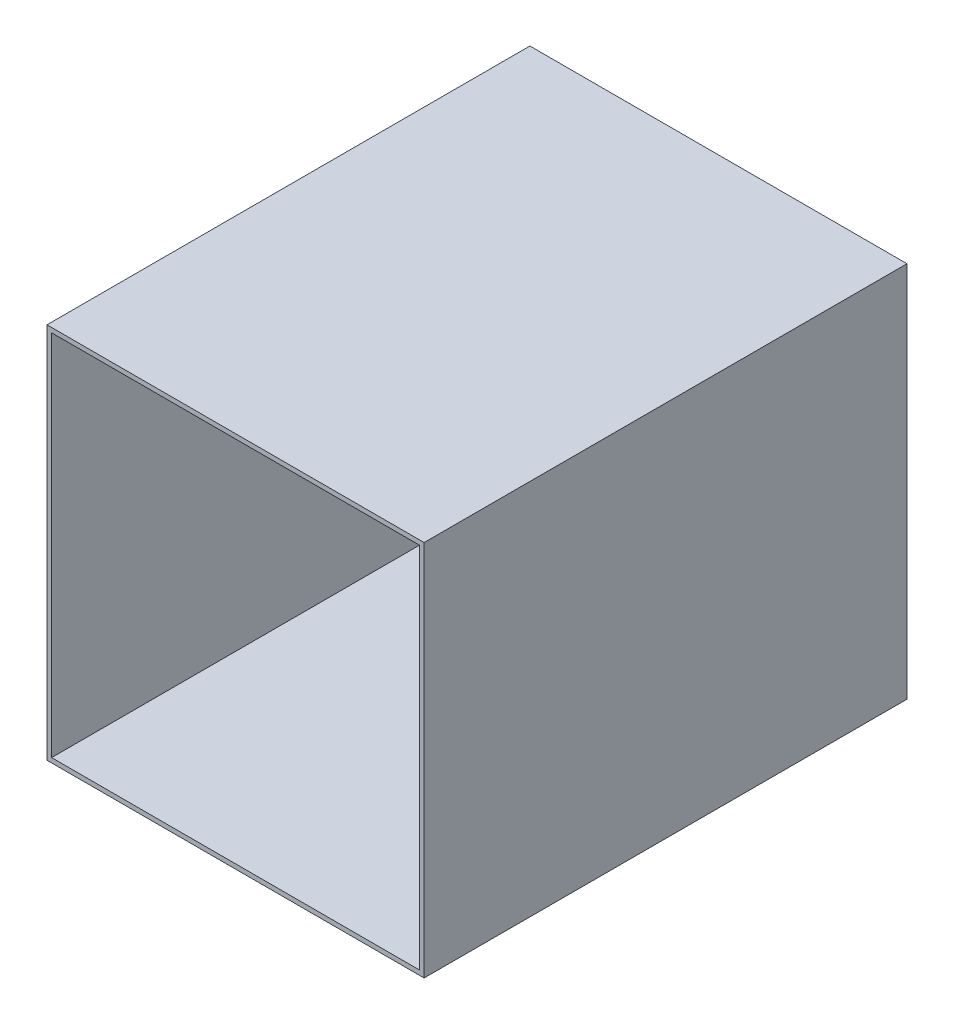
ISO-10303-21;
HEADER;
FILE_DESCRIPTION(('STEP AP214'),'2;1');
FILE_NAME('part.step','',(''),(''),'','','');
FILE_SCHEMA(('AUTOMOTIVE_DESIGN { 1 0 10303 214 1 1 1 1 }'));
ENDSEC;
DATA;
#1=APPLICATION_CONTEXT('core data for automotive mechanical design processes');
#2=APPLICATION_PROTOCOL_DEFINITION('international standard','automotive_design',2000,#1);
#3=PRODUCT_CONTEXT('',#1,'mechanical');
#4=PRODUCT('Part','Part','',(#3));
#5=PRODUCT_RELATED_PRODUCT_CATEGORY('part','',(#4));
#6=PRODUCT_DEFINITION_FORMATION('','',#4);
#7=PRODUCT_DEFINITION_CONTEXT('part definition',#1,'design');
#8=PRODUCT_DEFINITION('design','',#6,#7);
#9=PRODUCT_DEFINITION_SHAPE('','',#8);
#10=(LENGTH_UNIT() NAMED_UNIT(*) SI_UNIT(.MILLI.,.METRE.));
#11=(NAMED_UNIT(*) PLANE_ANGLE_UNIT() SI_UNIT($,.RADIAN.));
#12=(NAMED_UNIT(*) SI_UNIT($,.STERADIAN.) SOLID_ANGLE_UNIT());
#13=UNCERTAINTY_MEASURE_WITH_UNIT(LENGTH_MEASURE(1.E-05),#10,'distance_accuracy_value','');
#14=(GEOMETRIC_REPRESENTATION_CONTEXT(3) GLOBAL_UNCERTAINTY_ASSIGNED_CONTEXT((#13)) GLOBAL_UNIT_ASSIGNED_CONTEXT((#10,
#11,#12)) REPRESENTATION_CONTEXT('',''));
#15=CARTESIAN_POINT('',(0.,0.,0.));
#16=DIRECTION('',(0.,0.,1.));
#17=DIRECTION('',(1.,0.,0.));
#18=AXIS2_PLACEMENT_3D('',#15,#16,#17);
#19=CARTESIAN_POINT('',(0.,0.,330.2));
#20=DIRECTION('',(0.,0.,-1.));
#21=DIRECTION('',(-1.,0.,0.));
#22=AXIS2_PLACEMENT_3D('',#19,#20,#21);
#23=PLANE('',#22);
#24=DIRECTION('',(0.,-1.,0.));
#25=VECTOR('',#24,1.);
#26=CARTESIAN_POINT('',(-3.175,-3.175,330.2));
#27=LINE('',#26,#25);
#28=CARTESIAN_POINT('',(-3.175,257.175,330.2));
#29=VERTEX_POINT('',#28);
#30=CARTESIAN_POINT('',(-3.175,-3.175,330.2));
#31=VERTEX_POINT('',#30);
#32=EDGE_CURVE('E103',#29,#31,#27,.T.);
#33=ORIENTED_EDGE('',*,*,#32,.T.);
#34=DIRECTION('',(1.,0.,0.));
#35=VECTOR('',#34,1.);
#36=CARTESIAN_POINT('',(-3.175,-3.175,330.2));
#37=LINE('',#36,#35);
#38=CARTESIAN_POINT('',(257.175,-3.175,330.2));
#39=VERTEX_POINT('',#38);
#40=EDGE_CURVE('E152',#31,#39,#37,.T.);
#41=ORIENTED_EDGE('',*,*,#40,.T.);
#42=DIRECTION('',(0.,1.,0.));
#43=VECTOR('',#42,1.);
#44=CARTESIAN_POINT('',(257.175,-3.175,330.2));
#45=LINE('',#44,#43);
#46=CARTESIAN_POINT('',(257.175,257.175,330.2));
#47=VERTEX_POINT('',#46);
#48=EDGE_CURVE('E154',#39,#47,#45,.T.);
#49=ORIENTED_EDGE('',*,*,#48,.T.);
#50=DIRECTION('',(-1.,0.,0.));
#51=VECTOR('',#50,1.);
#52=CARTESIAN_POINT('',(-3.175,257.175,330.2));
#53=LINE('',#52,#51);
#54=EDGE_CURVE('E55',#47,#29,#53,.T.);
#55=ORIENTED_EDGE('',*,*,#54,.T.);
#56=EDGE_LOOP('',(#33,#41,#49,#55));
#57=FACE_BOUND('',#56,.T.);
#58=DIRECTION('',(0.,-1.,0.));
#59=VECTOR('',#58,1.);
#60=CARTESIAN_POINT('',(0.,0.,330.2));
#61=LINE('',#60,#59);
#62=CARTESIAN_POINT('',(0.,254.,330.2));
#63=VERTEX_POINT('',#62);
#64=CARTESIAN_POINT('',(0.,0.,330.2));
#65=VERTEX_POINT('',#64);
#66=EDGE_CURVE('E124',#63,#65,#61,.T.);
#67=ORIENTED_EDGE('',*,*,#66,.F.);
#68=DIRECTION('',(-1.,0.,0.));
#69=VECTOR('',#68,1.);
#70=CARTESIAN_POINT('',(0.,254.,330.2));
#71=LINE('',#70,#69);
#72=CARTESIAN_POINT('',(254.,254.,330.2));
#73=VERTEX_POINT('',#72);
#74=EDGE_CURVE('E131',#73,#63,#71,.T.);
#75=ORIENTED_EDGE('',*,*,#74,.F.);
#76=DIRECTION('',(0.,1.,0.));
#77=VECTOR('',#76,1.);
#78=CARTESIAN_POINT('',(254.,0.,330.2));
#79=LINE('',#78,#77);
#80=CARTESIAN_POINT('',(254.,0.,330.2));
#81=VERTEX_POINT('',#80);
#82=EDGE_CURVE('E129',#81,#73,#79,.T.);
#83=ORIENTED_EDGE('',*,*,#82,.F.);
#84=DIRECTION('',(1.,0.,0.));
#85=VECTOR('',#84,1.);
#86=CARTESIAN_POINT('',(0.,0.,330.2));
#87=LINE('',#86,#85);
#88=EDGE_CURVE('E126',#65,#81,#87,.T.);
#89=ORIENTED_EDGE('',*,*,#88,.F.);
#90=EDGE_LOOP('',(#67,#75,#83,#89));
#91=FACE_BOUND('',#90,.T.);
#92=ADVANCED_FACE('F32',(#57,#91),#23,.F.);
#93=CARTESIAN_POINT('',(-3.175,-3.175,330.2));
#94=DIRECTION('',(1.,0.,0.));
#95=DIRECTION('',(0.,0.,-1.));
#96=AXIS2_PLACEMENT_3D('',#93,#94,#95);
#97=PLANE('',#96);
#98=DIRECTION('',(0.,0.,-1.));
#99=VECTOR('',#98,1.);
#100=CARTESIAN_POINT('',(-3.175,257.175,330.2));
#101=LINE('',#100,#99);
#102=CARTESIAN_POINT('',(-3.175,257.175,-3.175));
#103=VERTEX_POINT('',#102);
#104=EDGE_CURVE('E97',#29,#103,#101,.T.);
#105=ORIENTED_EDGE('',*,*,#104,.T.);
#106=DIRECTION('',(0.,1.,0.));
#107=VECTOR('',#106,1.);
#108=CARTESIAN_POINT('',(-3.175,-3.175,-3.175));
#109=LINE('',#108,#107);
#110=CARTESIAN_POINT('',(-3.175,-3.175,-3.175));
#111=VERTEX_POINT('',#110);
#112=EDGE_CURVE('E101',#111,#103,#109,.T.);
#113=ORIENTED_EDGE('',*,*,#112,.F.);
#114=DIRECTION('',(0.,0.,-1.));
#115=VECTOR('',#114,1.);
#116=CARTESIAN_POINT('',(-3.175,-3.175,330.2));
#117=LINE('',#116,#115);
#118=EDGE_CURVE('E11',#31,#111,#117,.T.);
#119=ORIENTED_EDGE('',*,*,#118,.F.);
#120=ORIENTED_EDGE('',*,*,#32,.F.);
#121=EDGE_LOOP('',(#105,#113,#119,#120));
#122=FACE_BOUND('',#121,.T.);
#123=ADVANCED_FACE('F34',(#122),#97,.F.);
#124=CARTESIAN_POINT('',(-3.175,-3.175,330.2));
#125=DIRECTION('',(0.,1.,0.));
#126=DIRECTION('',(0.,0.,1.));
#127=AXIS2_PLACEMENT_3D('',#124,#125,#126);
#128=PLANE('',#127);
#129=ORIENTED_EDGE('',*,*,#118,.T.);
#130=DIRECTION('',(1.,0.,0.));
#131=VECTOR('',#130,1.);
#132=CARTESIAN_POINT('',(-3.175,-3.175,-3.175));
#133=LINE('',#132,#131);
#134=CARTESIAN_POINT('',(257.175,-3.175,-3.175));
#135=VERTEX_POINT('',#134);
#136=EDGE_CURVE('E118',#111,#135,#133,.T.);
#137=ORIENTED_EDGE('',*,*,#136,.T.);
#138=DIRECTION('',(0.,0.,-1.));
#139=VECTOR('',#138,1.);
#140=CARTESIAN_POINT('',(257.175,-3.175,330.2));
#141=LINE('',#140,#139);
#142=EDGE_CURVE('E40',#39,#135,#141,.T.);
#143=ORIENTED_EDGE('',*,*,#142,.F.);
#144=ORIENTED_EDGE('',*,*,#40,.F.);
#145=EDGE_LOOP('',(#129,#137,#143,#144));
#146=FACE_BOUND('',#145,.T.);
#147=ADVANCED_FACE('F162',(#146),#128,.F.);
#148=CARTESIAN_POINT('',(257.175,-3.175,330.2));
#149=DIRECTION('',(-1.,0.,0.));
#150=DIRECTION('',(0.,0.,1.));
#151=AXIS2_PLACEMENT_3D('',#148,#149,#150);
#152=PLANE('',#151);
#153=ORIENTED_EDGE('',*,*,#142,.T.);
#154=DIRECTION('',(0.,1.,0.));
#155=VECTOR('',#154,1.);
#156=CARTESIAN_POINT('',(257.175,-3.175,-3.175));
#157=LINE('',#156,#155);
#158=CARTESIAN_POINT('',(257.175,257.175,-3.175));
#159=VERTEX_POINT('',#158);
#160=EDGE_CURVE('E114',#135,#159,#157,.T.);
#161=ORIENTED_EDGE('',*,*,#160,.T.);
#162=DIRECTION('',(0.,0.,-1.));
#163=VECTOR('',#162,1.);
#164=CARTESIAN_POINT('',(257.175,257.175,330.2));
#165=LINE('',#164,#163);
#166=EDGE_CURVE('E105',#47,#159,#165,.T.);
#167=ORIENTED_EDGE('',*,*,#166,.F.);
#168=ORIENTED_EDGE('',*,*,#48,.F.);
#169=EDGE_LOOP('',(#153,#161,#167,#168));
#170=FACE_BOUND('',#169,.T.);
#171=ADVANCED_FACE('F160',(#170),#152,.F.);
#172=CARTESIAN_POINT('',(-3.175,257.175,330.2));
#173=DIRECTION('',(0.,-1.,0.));
#174=DIRECTION('',(0.,0.,-1.));
#175=AXIS2_PLACEMENT_3D('',#172,#173,#174);
#176=PLANE('',#175);
#177=ORIENTED_EDGE('',*,*,#166,.T.);
#178=DIRECTION('',(1.,0.,0.));
#179=VECTOR('',#178,1.);
#180=CARTESIAN_POINT('',(-3.175,257.175,-3.175));
#181=LINE('',#180,#179);
#182=EDGE_CURVE('E108',#103,#159,#181,.T.);
#183=ORIENTED_EDGE('',*,*,#182,.F.);
#184=ORIENTED_EDGE('',*,*,#104,.F.);
#185=ORIENTED_EDGE('',*,*,#54,.F.);
#186=EDGE_LOOP('',(#177,#183,#184,#185));
#187=FACE_BOUND('',#186,.T.);
#188=ADVANCED_FACE('F109',(#187),#176,.F.);
#189=CARTESIAN_POINT('',(0.,0.,330.2));
#190=DIRECTION('',(1.,0.,0.));
#191=DIRECTION('',(0.,0.,-1.));
#192=AXIS2_PLACEMENT_3D('',#189,#190,#191);
#193=PLANE('',#192);
#194=DIRECTION('',(0.,-1.,0.));
#195=VECTOR('',#194,1.);
#196=CARTESIAN_POINT('',(0.,0.,0.));
#197=LINE('',#196,#195);
#198=CARTESIAN_POINT('',(0.,254.,0.));
#199=VERTEX_POINT('',#198);
#200=CARTESIAN_POINT('',(0.,0.,0.));
#201=VERTEX_POINT('',#200);
#202=EDGE_CURVE('E123',#199,#201,#197,.T.);
#203=ORIENTED_EDGE('',*,*,#202,.F.);
#204=DIRECTION('',(0.,0.,-1.));
#205=VECTOR('',#204,1.);
#206=CARTESIAN_POINT('',(0.,254.,330.2));
#207=LINE('',#206,#205);
#208=EDGE_CURVE('E133',#63,#199,#207,.T.);
#209=ORIENTED_EDGE('',*,*,#208,.F.);
#210=ORIENTED_EDGE('',*,*,#66,.T.);
#211=DIRECTION('',(0.,0.,-1.));
#212=VECTOR('',#211,1.);
#213=CARTESIAN_POINT('',(0.,0.,330.2));
#214=LINE('',#213,#212);
#215=EDGE_CURVE('E148',#65,#201,#214,.T.);
#216=ORIENTED_EDGE('',*,*,#215,.T.);
#217=EDGE_LOOP('',(#203,#209,#210,#216));
#218=FACE_BOUND('',#217,.T.);
#219=ADVANCED_FACE('F174',(#218),#193,.T.);
#220=CARTESIAN_POINT('',(0.,0.,330.2));
#221=DIRECTION('',(0.,1.,0.));
#222=DIRECTION('',(0.,0.,1.));
#223=AXIS2_PLACEMENT_3D('',#220,#221,#222);
#224=PLANE('',#223);
#225=DIRECTION('',(1.,0.,0.));
#226=VECTOR('',#225,1.);
#227=CARTESIAN_POINT('',(0.,0.,0.));
#228=LINE('',#227,#226);
#229=CARTESIAN_POINT('',(254.,0.,0.));
#230=VERTEX_POINT('',#229);
#231=EDGE_CURVE('E136',#201,#230,#228,.T.);
#232=ORIENTED_EDGE('',*,*,#231,.F.);
#233=ORIENTED_EDGE('',*,*,#215,.F.);
#234=ORIENTED_EDGE('',*,*,#88,.T.);
#235=DIRECTION('',(0.,0.,-1.));
#236=VECTOR('',#235,1.);
#237=CARTESIAN_POINT('',(254.,0.,330.2));
#238=LINE('',#237,#236);
#239=EDGE_CURVE('E146',#81,#230,#238,.T.);
#240=ORIENTED_EDGE('',*,*,#239,.T.);
#241=EDGE_LOOP('',(#232,#233,#234,#240));
#242=FACE_BOUND('',#241,.T.);
#243=ADVANCED_FACE('F176',(#242),#224,.T.);
#244=CARTESIAN_POINT('',(254.,0.,330.2));
#245=DIRECTION('',(-1.,0.,0.));
#246=DIRECTION('',(0.,0.,1.));
#247=AXIS2_PLACEMENT_3D('',#244,#245,#246);
#248=PLANE('',#247);
#249=DIRECTION('',(0.,1.,0.));
#250=VECTOR('',#249,1.);
#251=CARTESIAN_POINT('',(254.,0.,0.));
#252=LINE('',#251,#250);
#253=CARTESIAN_POINT('',(254.,254.,0.));
#254=VERTEX_POINT('',#253);
#255=EDGE_CURVE('E139',#230,#254,#252,.T.);
#256=ORIENTED_EDGE('',*,*,#255,.F.);
#257=ORIENTED_EDGE('',*,*,#239,.F.);
#258=ORIENTED_EDGE('',*,*,#82,.T.);
#259=DIRECTION('',(0.,0.,-1.));
#260=VECTOR('',#259,1.);
#261=CARTESIAN_POINT('',(254.,254.,330.2));
#262=LINE('',#261,#260);
#263=EDGE_CURVE('E47',#73,#254,#262,.T.);
#264=ORIENTED_EDGE('',*,*,#263,.T.);
#265=EDGE_LOOP('',(#256,#257,#258,#264));
#266=FACE_BOUND('',#265,.T.);
#267=ADVANCED_FACE('F183',(#266),#248,.T.);
#268=CARTESIAN_POINT('',(0.,254.,330.2));
#269=DIRECTION('',(0.,-1.,0.));
#270=DIRECTION('',(0.,0.,-1.));
#271=AXIS2_PLACEMENT_3D('',#268,#269,#270);
#272=PLANE('',#271);
#273=DIRECTION('',(-1.,0.,0.));
#274=VECTOR('',#273,1.);
#275=CARTESIAN_POINT('',(0.,254.,0.));
#276=LINE('',#275,#274);
#277=EDGE_CURVE('E127',#254,#199,#276,.T.);
#278=ORIENTED_EDGE('',*,*,#277,.F.);
#279=ORIENTED_EDGE('',*,*,#263,.F.);
#280=ORIENTED_EDGE('',*,*,#74,.T.);
#281=ORIENTED_EDGE('',*,*,#208,.T.);
#282=EDGE_LOOP('',(#278,#279,#280,#281));
#283=FACE_BOUND('',#282,.T.);
#284=ADVANCED_FACE('F181',(#283),#272,.T.);
#285=CARTESIAN_POINT('',(0.,0.,0.));
#286=DIRECTION('',(0.,0.,-1.));
#287=DIRECTION('',(-1.,0.,0.));
#288=AXIS2_PLACEMENT_3D('',#285,#286,#287);
#289=PLANE('',#288);
#290=ORIENTED_EDGE('',*,*,#202,.T.);
#291=ORIENTED_EDGE('',*,*,#231,.T.);
#292=ORIENTED_EDGE('',*,*,#255,.T.);
#293=ORIENTED_EDGE('',*,*,#277,.T.);
#294=EDGE_LOOP('',(#290,#291,#292,#293));
#295=FACE_BOUND('',#294,.T.);
#296=ADVANCED_FACE('F180',(#295),#289,.F.);
#297=CARTESIAN_POINT('',(0.,0.,-3.175));
#298=DIRECTION('',(0.,0.,-1.));
#299=DIRECTION('',(-1.,0.,0.));
#300=AXIS2_PLACEMENT_3D('',#297,#298,#299);
#301=PLANE('',#300);
#302=ORIENTED_EDGE('',*,*,#112,.T.);
#303=ORIENTED_EDGE('',*,*,#182,.T.);
#304=ORIENTED_EDGE('',*,*,#160,.F.);
#305=ORIENTED_EDGE('',*,*,#136,.F.);
#306=EDGE_LOOP('',(#302,#303,#304,#305));
#307=FACE_BOUND('',#306,.T.);
#308=ADVANCED_FACE('F116',(#307),#301,.T.);
#309=CLOSED_SHELL('',(#92,#123,#147,#171,#188,#219,#243,#267,#284,#296,#308));
#310=MANIFOLD_SOLID_BREP('B2',#309);
#311=ADVANCED_BREP_SHAPE_REPRESENTATION('',(#18,#310),#14);
#312=SHAPE_DEFINITION_REPRESENTATION(#9,#311);
ENDSEC;
END-ISO-10303-21;
